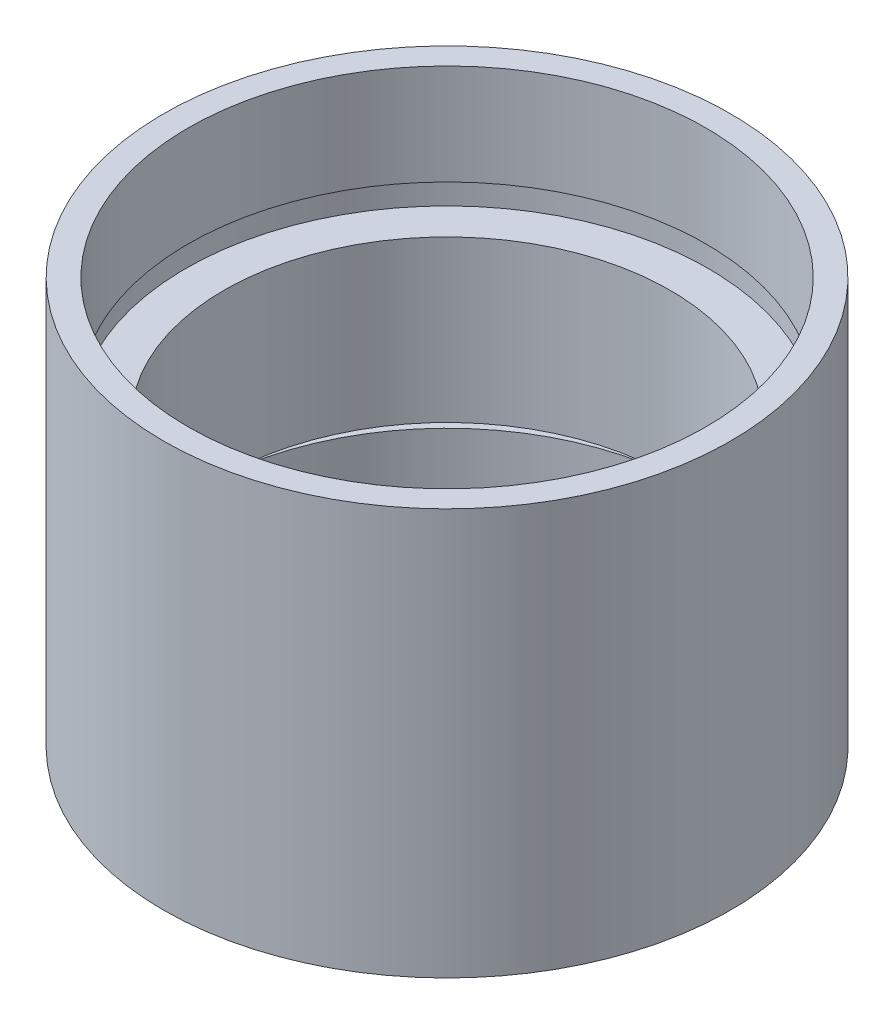
ISO-10303-21;
HEADER;
FILE_DESCRIPTION(('STEP AP214'),'2;1');
FILE_NAME('part.step','',(''),(''),'','','');
FILE_SCHEMA(('AUTOMOTIVE_DESIGN { 1 0 10303 214 1 1 1 1 }'));
ENDSEC;
DATA;
#1=APPLICATION_CONTEXT('core data for automotive mechanical design processes');
#2=APPLICATION_PROTOCOL_DEFINITION('international standard','automotive_design',2000,#1);
#3=PRODUCT_CONTEXT('',#1,'mechanical');
#4=PRODUCT('Part','Part','',(#3));
#5=PRODUCT_RELATED_PRODUCT_CATEGORY('part','',(#4));
#6=PRODUCT_DEFINITION_FORMATION('','',#4);
#7=PRODUCT_DEFINITION_CONTEXT('part definition',#1,'design');
#8=PRODUCT_DEFINITION('design','',#6,#7);
#9=PRODUCT_DEFINITION_SHAPE('','',#8);
#10=(LENGTH_UNIT() NAMED_UNIT(*) SI_UNIT(.MILLI.,.METRE.));
#11=(NAMED_UNIT(*) PLANE_ANGLE_UNIT() SI_UNIT($,.RADIAN.));
#12=(NAMED_UNIT(*) SI_UNIT($,.STERADIAN.) SOLID_ANGLE_UNIT());
#13=UNCERTAINTY_MEASURE_WITH_UNIT(LENGTH_MEASURE(1.E-05),#10,'distance_accuracy_value','');
#14=(GEOMETRIC_REPRESENTATION_CONTEXT(3) GLOBAL_UNCERTAINTY_ASSIGNED_CONTEXT((#13)) GLOBAL_UNIT_ASSIGNED_CONTEXT((#10,
#11,#12)) REPRESENTATION_CONTEXT('',''));
#15=CARTESIAN_POINT('',(0.,0.,0.));
#16=DIRECTION('',(0.,0.,1.));
#17=DIRECTION('',(1.,0.,0.));
#18=AXIS2_PLACEMENT_3D('',#15,#16,#17);
#19=CARTESIAN_POINT('',(11.1,0.,0.));
#20=DIRECTION('',(0.,1.,0.));
#21=DIRECTION('',(0.,0.,1.));
#22=AXIS2_PLACEMENT_3D('',#19,#20,#21);
#23=PLANE('',#22);
#24=CARTESIAN_POINT('',(0.,0.,0.));
#25=DIRECTION('',(0.,1.,0.));
#26=DIRECTION('',(0.,0.,1.));
#27=AXIS2_PLACEMENT_3D('',#24,#25,#26);
#28=CIRCLE('',#27,12.7);
#29=CARTESIAN_POINT('',(0.,0.,12.7));
#30=VERTEX_POINT('',#29);
#31=EDGE_CURVE('E10',#30,#30,#28,.T.);
#32=ORIENTED_EDGE('',*,*,#31,.F.);
#33=EDGE_LOOP('',(#32));
#34=FACE_BOUND('',#33,.T.);
#35=CARTESIAN_POINT('',(0.,0.,0.));
#36=DIRECTION('',(0.,1.,0.));
#37=DIRECTION('',(0.,0.,1.));
#38=AXIS2_PLACEMENT_3D('',#35,#36,#37);
#39=CIRCLE('',#38,11.1);
#40=CARTESIAN_POINT('',(0.,0.,11.1));
#41=VERTEX_POINT('',#40);
#42=EDGE_CURVE('E77',#41,#41,#39,.T.);
#43=ORIENTED_EDGE('',*,*,#42,.T.);
#44=EDGE_LOOP('',(#43));
#45=FACE_BOUND('',#44,.T.);
#46=ADVANCED_FACE('F37',(#34,#45),#23,.F.);
#47=CARTESIAN_POINT('',(0.,161.376166943427,0.));
#48=DIRECTION('',(0.,1.,0.));
#49=DIRECTION('',(0.,0.,1.));
#50=AXIS2_PLACEMENT_3D('',#47,#48,#49);
#51=CYLINDRICAL_SURFACE('',#50,12.7);
#52=CARTESIAN_POINT('',(0.,18.2,0.));
#53=DIRECTION('',(0.,1.,0.));
#54=DIRECTION('',(0.,0.,1.));
#55=AXIS2_PLACEMENT_3D('',#52,#53,#54);
#56=CIRCLE('',#55,12.7);
#57=CARTESIAN_POINT('',(0.,18.2,12.7));
#58=VERTEX_POINT('',#57);
#59=EDGE_CURVE('E43',#58,#58,#56,.T.);
#60=ORIENTED_EDGE('',*,*,#59,.F.);
#61=EDGE_LOOP('',(#60));
#62=FACE_BOUND('',#61,.T.);
#63=ORIENTED_EDGE('',*,*,#31,.T.);
#64=EDGE_LOOP('',(#63));
#65=FACE_BOUND('',#64,.T.);
#66=ADVANCED_FACE('F138',(#62,#65),#51,.T.);
#67=CARTESIAN_POINT('',(11.6,18.2,0.));
#68=DIRECTION('',(0.,-1.,0.));
#69=DIRECTION('',(0.,0.,-1.));
#70=AXIS2_PLACEMENT_3D('',#67,#68,#69);
#71=PLANE('',#70);
#72=CARTESIAN_POINT('',(0.,18.2,0.));
#73=DIRECTION('',(0.,1.,0.));
#74=DIRECTION('',(0.,0.,1.));
#75=AXIS2_PLACEMENT_3D('',#72,#73,#74);
#76=CIRCLE('',#75,11.6);
#77=CARTESIAN_POINT('',(0.,18.2,11.6));
#78=VERTEX_POINT('',#77);
#79=EDGE_CURVE('E47',#78,#78,#76,.T.);
#80=ORIENTED_EDGE('',*,*,#79,.F.);
#81=EDGE_LOOP('',(#80));
#82=FACE_BOUND('',#81,.T.);
#83=ORIENTED_EDGE('',*,*,#59,.T.);
#84=EDGE_LOOP('',(#83));
#85=FACE_BOUND('',#84,.T.);
#86=ADVANCED_FACE('F133',(#82,#85),#71,.F.);
#87=CARTESIAN_POINT('',(0.,161.376166943427,0.));
#88=DIRECTION('',(0.,1.,0.));
#89=DIRECTION('',(0.,0.,1.));
#90=AXIS2_PLACEMENT_3D('',#87,#88,#89);
#91=CYLINDRICAL_SURFACE('',#90,11.6);
#92=CARTESIAN_POINT('',(0.,13.7,0.));
#93=DIRECTION('',(0.,1.,0.));
#94=DIRECTION('',(0.,0.,1.));
#95=AXIS2_PLACEMENT_3D('',#92,#93,#94);
#96=CIRCLE('',#95,11.6);
#97=CARTESIAN_POINT('',(0.,13.7,11.6));
#98=VERTEX_POINT('',#97);
#99=EDGE_CURVE('E51',#98,#98,#96,.T.);
#100=ORIENTED_EDGE('',*,*,#99,.F.);
#101=EDGE_LOOP('',(#100));
#102=FACE_BOUND('',#101,.T.);
#103=ORIENTED_EDGE('',*,*,#79,.T.);
#104=EDGE_LOOP('',(#103));
#105=FACE_BOUND('',#104,.T.);
#106=ADVANCED_FACE('F127',(#102,#105),#91,.F.);
#107=CARTESIAN_POINT('',(11.6,13.7,0.));
#108=DIRECTION('',(0.,1.,0.));
#109=DIRECTION('',(0.,0.,1.));
#110=AXIS2_PLACEMENT_3D('',#107,#108,#109);
#111=PLANE('',#110);
#112=CARTESIAN_POINT('',(0.,13.7,0.));
#113=DIRECTION('',(0.,1.,0.));
#114=DIRECTION('',(0.,0.,1.));
#115=AXIS2_PLACEMENT_3D('',#112,#113,#114);
#116=CIRCLE('',#115,11.7);
#117=CARTESIAN_POINT('',(0.,13.7,11.7));
#118=VERTEX_POINT('',#117);
#119=EDGE_CURVE('E56',#118,#118,#116,.T.);
#120=ORIENTED_EDGE('',*,*,#119,.F.);
#121=EDGE_LOOP('',(#120));
#122=FACE_BOUND('',#121,.T.);
#123=ORIENTED_EDGE('',*,*,#99,.T.);
#124=EDGE_LOOP('',(#123));
#125=FACE_BOUND('',#124,.T.);
#126=ADVANCED_FACE('F121',(#122,#125),#111,.F.);
#127=CARTESIAN_POINT('',(0.,161.376166943427,0.));
#128=DIRECTION('',(0.,1.,0.));
#129=DIRECTION('',(0.,0.,1.));
#130=AXIS2_PLACEMENT_3D('',#127,#128,#129);
#131=CYLINDRICAL_SURFACE('',#130,11.7);
#132=CARTESIAN_POINT('',(0.,12.7,0.));
#133=DIRECTION('',(0.,1.,0.));
#134=DIRECTION('',(0.,0.,1.));
#135=AXIS2_PLACEMENT_3D('',#132,#133,#134);
#136=CIRCLE('',#135,11.7);
#137=CARTESIAN_POINT('',(0.,12.7,11.7));
#138=VERTEX_POINT('',#137);
#139=EDGE_CURVE('E59',#138,#138,#136,.T.);
#140=ORIENTED_EDGE('',*,*,#139,.F.);
#141=EDGE_LOOP('',(#140));
#142=FACE_BOUND('',#141,.T.);
#143=ORIENTED_EDGE('',*,*,#119,.T.);
#144=EDGE_LOOP('',(#143));
#145=FACE_BOUND('',#144,.T.);
#146=ADVANCED_FACE('F115',(#142,#145),#131,.F.);
#147=CARTESIAN_POINT('',(10.,12.7,0.));
#148=DIRECTION('',(0.,-1.,0.));
#149=DIRECTION('',(0.,0.,-1.));
#150=AXIS2_PLACEMENT_3D('',#147,#148,#149);
#151=PLANE('',#150);
#152=CARTESIAN_POINT('',(0.,12.7,0.));
#153=DIRECTION('',(0.,1.,0.));
#154=DIRECTION('',(0.,0.,1.));
#155=AXIS2_PLACEMENT_3D('',#152,#153,#154);
#156=CIRCLE('',#155,10.);
#157=CARTESIAN_POINT('',(0.,12.7,10.));
#158=VERTEX_POINT('',#157);
#159=EDGE_CURVE('E62',#158,#158,#156,.T.);
#160=ORIENTED_EDGE('',*,*,#159,.F.);
#161=EDGE_LOOP('',(#160));
#162=FACE_BOUND('',#161,.T.);
#163=ORIENTED_EDGE('',*,*,#139,.T.);
#164=EDGE_LOOP('',(#163));
#165=FACE_BOUND('',#164,.T.);
#166=ADVANCED_FACE('F109',(#162,#165),#151,.F.);
#167=CARTESIAN_POINT('',(0.,161.376166943427,0.));
#168=DIRECTION('',(0.,1.,0.));
#169=DIRECTION('',(0.,0.,1.));
#170=AXIS2_PLACEMENT_3D('',#167,#168,#169);
#171=CYLINDRICAL_SURFACE('',#170,10.);
#172=CARTESIAN_POINT('',(0.,5.49999999999998,0.));
#173=DIRECTION('',(0.,1.,0.));
#174=DIRECTION('',(0.,0.,1.));
#175=AXIS2_PLACEMENT_3D('',#172,#173,#174);
#176=CIRCLE('',#175,10.);
#177=CARTESIAN_POINT('',(0.,5.49999999999998,10.));
#178=VERTEX_POINT('',#177);
#179=EDGE_CURVE('E65',#178,#178,#176,.T.);
#180=ORIENTED_EDGE('',*,*,#179,.F.);
#181=EDGE_LOOP('',(#180));
#182=FACE_BOUND('',#181,.T.);
#183=ORIENTED_EDGE('',*,*,#159,.T.);
#184=EDGE_LOOP('',(#183));
#185=FACE_BOUND('',#184,.T.);
#186=ADVANCED_FACE('F103',(#182,#185),#171,.F.);
#187=CARTESIAN_POINT('',(11.7,5.49999999999998,0.));
#188=DIRECTION('',(0.,1.,0.));
#189=DIRECTION('',(0.,0.,1.));
#190=AXIS2_PLACEMENT_3D('',#187,#188,#189);
#191=PLANE('',#190);
#192=CARTESIAN_POINT('',(0.,5.49999999999998,0.));
#193=DIRECTION('',(0.,1.,0.));
#194=DIRECTION('',(0.,0.,1.));
#195=AXIS2_PLACEMENT_3D('',#192,#193,#194);
#196=CIRCLE('',#195,11.7);
#197=CARTESIAN_POINT('',(0.,5.49999999999998,11.7));
#198=VERTEX_POINT('',#197);
#199=EDGE_CURVE('E68',#198,#198,#196,.T.);
#200=ORIENTED_EDGE('',*,*,#199,.F.);
#201=EDGE_LOOP('',(#200));
#202=FACE_BOUND('',#201,.T.);
#203=ORIENTED_EDGE('',*,*,#179,.T.);
#204=EDGE_LOOP('',(#203));
#205=FACE_BOUND('',#204,.T.);
#206=ADVANCED_FACE('F97',(#202,#205),#191,.F.);
#207=CARTESIAN_POINT('',(0.,161.376166943427,0.));
#208=DIRECTION('',(0.,1.,0.));
#209=DIRECTION('',(0.,0.,1.));
#210=AXIS2_PLACEMENT_3D('',#207,#208,#209);
#211=CYLINDRICAL_SURFACE('',#210,11.7);
#212=CARTESIAN_POINT('',(0.,4.49999999999998,0.));
#213=DIRECTION('',(0.,1.,0.));
#214=DIRECTION('',(0.,0.,1.));
#215=AXIS2_PLACEMENT_3D('',#212,#213,#214);
#216=CIRCLE('',#215,11.7);
#217=CARTESIAN_POINT('',(0.,4.49999999999998,11.7));
#218=VERTEX_POINT('',#217);
#219=EDGE_CURVE('E71',#218,#218,#216,.T.);
#220=ORIENTED_EDGE('',*,*,#219,.F.);
#221=EDGE_LOOP('',(#220));
#222=FACE_BOUND('',#221,.T.);
#223=ORIENTED_EDGE('',*,*,#199,.T.);
#224=EDGE_LOOP('',(#223));
#225=FACE_BOUND('',#224,.T.);
#226=ADVANCED_FACE('F91',(#222,#225),#211,.F.);
#227=CARTESIAN_POINT('',(11.1,4.49999999999998,0.));
#228=DIRECTION('',(0.,-1.,0.));
#229=DIRECTION('',(0.,0.,-1.));
#230=AXIS2_PLACEMENT_3D('',#227,#228,#229);
#231=PLANE('',#230);
#232=CARTESIAN_POINT('',(0.,4.49999999999998,0.));
#233=DIRECTION('',(0.,1.,0.));
#234=DIRECTION('',(0.,0.,1.));
#235=AXIS2_PLACEMENT_3D('',#232,#233,#234);
#236=CIRCLE('',#235,11.1);
#237=CARTESIAN_POINT('',(0.,4.49999999999998,11.1));
#238=VERTEX_POINT('',#237);
#239=EDGE_CURVE('E74',#238,#238,#236,.T.);
#240=ORIENTED_EDGE('',*,*,#239,.F.);
#241=EDGE_LOOP('',(#240));
#242=FACE_BOUND('',#241,.T.);
#243=ORIENTED_EDGE('',*,*,#219,.T.);
#244=EDGE_LOOP('',(#243));
#245=FACE_BOUND('',#244,.T.);
#246=ADVANCED_FACE('F85',(#242,#245),#231,.F.);
#247=CARTESIAN_POINT('',(0.,161.376166943427,0.));
#248=DIRECTION('',(0.,1.,0.));
#249=DIRECTION('',(0.,0.,1.));
#250=AXIS2_PLACEMENT_3D('',#247,#248,#249);
#251=CYLINDRICAL_SURFACE('',#250,11.1);
#252=ORIENTED_EDGE('',*,*,#42,.F.);
#253=EDGE_LOOP('',(#252));
#254=FACE_BOUND('',#253,.T.);
#255=ORIENTED_EDGE('',*,*,#239,.T.);
#256=EDGE_LOOP('',(#255));
#257=FACE_BOUND('',#256,.T.);
#258=ADVANCED_FACE('F82',(#254,#257),#251,.F.);
#259=CLOSED_SHELL('',(#46,#66,#86,#106,#126,#146,#166,#186,#206,#226,#246,#258));
#260=MANIFOLD_SOLID_BREP('B2',#259);
#261=ADVANCED_BREP_SHAPE_REPRESENTATION('',(#18,#260),#14);
#262=SHAPE_DEFINITION_REPRESENTATION(#9,#261);
ENDSEC;
END-ISO-10303-21;
